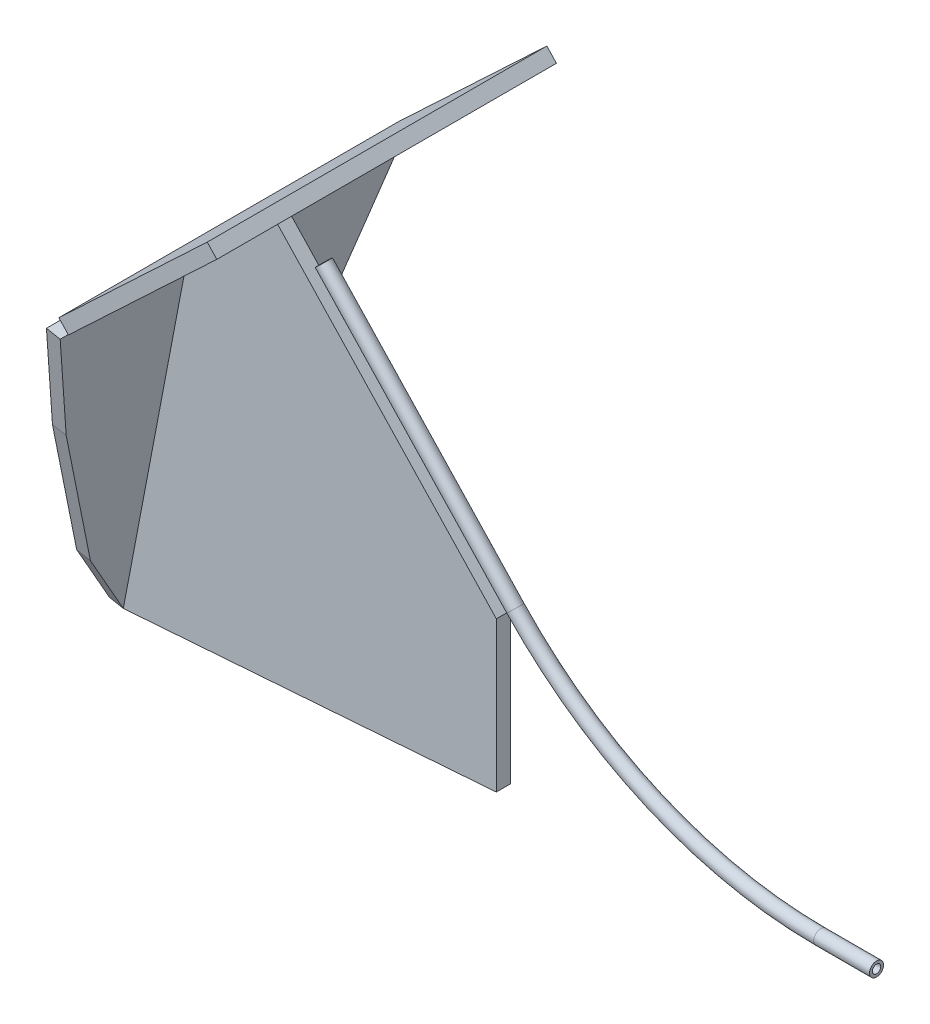
ISO-10303-21;
HEADER;
FILE_DESCRIPTION(('STEP AP214'),'2;1');
FILE_NAME('part.step','',(''),(''),'','','');
FILE_SCHEMA(('AUTOMOTIVE_DESIGN { 1 0 10303 214 1 1 1 1 }'));
ENDSEC;
DATA;
#1=APPLICATION_CONTEXT('core data for automotive mechanical design processes');
#2=APPLICATION_PROTOCOL_DEFINITION('international standard','automotive_design',2000,#1);
#3=PRODUCT_CONTEXT('',#1,'mechanical');
#4=PRODUCT('Part','Part','',(#3));
#5=PRODUCT_RELATED_PRODUCT_CATEGORY('part','',(#4));
#6=PRODUCT_DEFINITION_FORMATION('','',#4);
#7=PRODUCT_DEFINITION_CONTEXT('part definition',#1,'design');
#8=PRODUCT_DEFINITION('design','',#6,#7);
#9=PRODUCT_DEFINITION_SHAPE('','',#8);
#10=(LENGTH_UNIT() NAMED_UNIT(*) SI_UNIT(.MILLI.,.METRE.));
#11=(NAMED_UNIT(*) PLANE_ANGLE_UNIT() SI_UNIT($,.RADIAN.));
#12=(NAMED_UNIT(*) SI_UNIT($,.STERADIAN.) SOLID_ANGLE_UNIT());
#13=UNCERTAINTY_MEASURE_WITH_UNIT(LENGTH_MEASURE(1.E-05),#10,'distance_accuracy_value','');
#14=(GEOMETRIC_REPRESENTATION_CONTEXT(3) GLOBAL_UNCERTAINTY_ASSIGNED_CONTEXT((#13)) GLOBAL_UNIT_ASSIGNED_CONTEXT((#10,
#11,#12)) REPRESENTATION_CONTEXT('',''));
#15=CARTESIAN_POINT('',(0.,0.,0.));
#16=DIRECTION('',(0.,0.,1.));
#17=DIRECTION('',(1.,0.,0.));
#18=AXIS2_PLACEMENT_3D('',#15,#16,#17);
#19=CARTESIAN_POINT('',(-195.801486956078,133.854835002375,6.35));
#20=DIRECTION('',(0.685427348757883,-0.728141023136823,0.));
#21=DIRECTION('',(0.728141023136823,0.685427348757883,0.));
#22=AXIS2_PLACEMENT_3D('',#19,#20,#21);
#23=PLANE('',#22);
#24=DIRECTION('',(0.,0.,1.));
#25=VECTOR('',#24,1.);
#26=CARTESIAN_POINT('',(-232.967224151147,98.8692870098938,-90.9539252993437));
#27=LINE('',#26,#25);
#28=CARTESIAN_POINT('',(-232.967224151147,98.8692870098938,0.));
#29=VERTEX_POINT('',#28);
#30=CARTESIAN_POINT('',(-232.967224151147,98.8692870098938,6.35));
#31=VERTEX_POINT('',#30);
#32=EDGE_CURVE('E233',#29,#31,#27,.T.);
#33=ORIENTED_EDGE('',*,*,#32,.F.);
#34=DIRECTION('',(-0.728141023136823,-0.685427348757883,0.));
#35=VECTOR('',#34,1.);
#36=CARTESIAN_POINT('',(-195.801486956078,133.854835002375,0.));
#37=LINE('',#36,#35);
#38=CARTESIAN_POINT('',(-236.721174295515,95.3355483341922,0.));
#39=VERTEX_POINT('',#38);
#40=EDGE_CURVE('E131',#29,#39,#37,.T.);
#41=ORIENTED_EDGE('',*,*,#40,.T.);
#42=DIRECTION('',(0.,0.,-1.));
#43=VECTOR('',#42,1.);
#44=CARTESIAN_POINT('',(-236.721174295515,95.3355483341922,6.35));
#45=LINE('',#44,#43);
#46=CARTESIAN_POINT('',(-236.721174295515,95.3355483341922,6.35));
#47=VERTEX_POINT('',#46);
#48=EDGE_CURVE('E12',#47,#39,#45,.T.);
#49=ORIENTED_EDGE('',*,*,#48,.F.);
#50=DIRECTION('',(-0.728141023136823,-0.685427348757883,0.));
#51=VECTOR('',#50,1.);
#52=CARTESIAN_POINT('',(-195.801486956078,133.854835002375,6.35));
#53=LINE('',#52,#51);
#54=EDGE_CURVE('E61',#31,#47,#53,.T.);
#55=ORIENTED_EDGE('',*,*,#54,.F.);
#56=EDGE_LOOP('',(#33,#41,#49,#55));
#57=FACE_BOUND('',#56,.T.);
#58=ADVANCED_FACE('F47',(#57),#23,.F.);
#59=CARTESIAN_POINT('',(-95.5521655266669,-40.7968419471678,6.35));
#60=DIRECTION('',(-0.0735843814622596,0.997288994627343,0.));
#61=DIRECTION('',(-0.997288994627343,-0.0735843814622596,0.));
#62=AXIS2_PLACEMENT_3D('',#59,#60,#61);
#63=PLANE('',#62);
#64=DIRECTION('',(0.997288994627343,0.0735843814622596,0.));
#65=VECTOR('',#64,1.);
#66=CARTESIAN_POINT('',(-95.5521655266669,-40.7968419471678,0.));
#67=LINE('',#66,#65);
#68=CARTESIAN_POINT('',(-265.05056523705,-53.3031816026977,0.));
#69=VERTEX_POINT('',#68);
#70=CARTESIAN_POINT('',(-95.5521655266669,-40.7968419471678,0.));
#71=VERTEX_POINT('',#70);
#72=EDGE_CURVE('E116',#69,#71,#67,.T.);
#73=ORIENTED_EDGE('',*,*,#72,.T.);
#74=DIRECTION('',(0.,0.,-1.));
#75=VECTOR('',#74,1.);
#76=CARTESIAN_POINT('',(-95.5521655266669,-40.7968419471678,6.35));
#77=LINE('',#76,#75);
#78=CARTESIAN_POINT('',(-95.5521655266669,-40.7968419471678,6.35));
#79=VERTEX_POINT('',#78);
#80=EDGE_CURVE('E113',#79,#71,#77,.T.);
#81=ORIENTED_EDGE('',*,*,#80,.F.);
#82=DIRECTION('',(0.997288994627343,0.0735843814622596,0.));
#83=VECTOR('',#82,1.);
#84=CARTESIAN_POINT('',(-95.5521655266669,-40.7968419471678,6.35));
#85=LINE('',#84,#83);
#86=CARTESIAN_POINT('',(-265.05056523705,-53.3031816026976,6.35));
#87=VERTEX_POINT('',#86);
#88=EDGE_CURVE('E100',#87,#79,#85,.T.);
#89=ORIENTED_EDGE('',*,*,#88,.F.);
#90=DIRECTION('',(0.,0.,-1.));
#91=VECTOR('',#90,1.);
#92=CARTESIAN_POINT('',(-265.05056523705,-53.3031816026976,6.35));
#93=LINE('',#92,#91);
#94=EDGE_CURVE('E54',#87,#69,#93,.T.);
#95=ORIENTED_EDGE('',*,*,#94,.T.);
#96=EDGE_LOOP('',(#73,#81,#89,#95));
#97=FACE_BOUND('',#96,.T.);
#98=ADVANCED_FACE('F114',(#97),#63,.F.);
#99=CARTESIAN_POINT('',(-95.5521655266669,27.3582914858883,6.35));
#100=DIRECTION('',(-1.,0.,0.));
#101=DIRECTION('',(0.,0.,1.));
#102=AXIS2_PLACEMENT_3D('',#99,#100,#101);
#103=PLANE('',#102);
#104=DIRECTION('',(0.,1.,0.));
#105=VECTOR('',#104,1.);
#106=CARTESIAN_POINT('',(-95.5521655266669,27.3582914858883,0.));
#107=LINE('',#106,#105);
#108=CARTESIAN_POINT('',(-95.5521655266669,27.3582914858883,0.));
#109=VERTEX_POINT('',#108);
#110=EDGE_CURVE('E135',#71,#109,#107,.T.);
#111=ORIENTED_EDGE('',*,*,#110,.T.);
#112=DIRECTION('',(0.,0.,-1.));
#113=VECTOR('',#112,1.);
#114=CARTESIAN_POINT('',(-95.5521655266669,27.3582914858883,6.35));
#115=LINE('',#114,#113);
#116=CARTESIAN_POINT('',(-95.5521655266669,27.3582914858883,6.35));
#117=VERTEX_POINT('',#116);
#118=EDGE_CURVE('E119',#117,#109,#115,.T.);
#119=ORIENTED_EDGE('',*,*,#118,.F.);
#120=DIRECTION('',(0.,1.,0.));
#121=VECTOR('',#120,1.);
#122=CARTESIAN_POINT('',(-95.5521655266669,27.3582914858883,6.35));
#123=LINE('',#122,#121);
#124=EDGE_CURVE('E104',#79,#117,#123,.T.);
#125=ORIENTED_EDGE('',*,*,#124,.F.);
#126=ORIENTED_EDGE('',*,*,#80,.T.);
#127=EDGE_LOOP('',(#111,#119,#125,#126));
#128=FACE_BOUND('',#127,.T.);
#129=ADVANCED_FACE('F121',(#128),#103,.F.);
#130=CARTESIAN_POINT('',(-195.801486956078,133.854835002375,6.35));
#131=DIRECTION('',(-0.728141023136823,-0.685427348757882,0.));
#132=DIRECTION('',(0.685427348757882,-0.728141023136823,0.));
#133=AXIS2_PLACEMENT_3D('',#130,#131,#132);
#134=PLANE('',#133);
#135=DIRECTION('',(-0.685427348757882,0.728141023136823,0.));
#136=VECTOR('',#135,1.);
#137=CARTESIAN_POINT('',(-195.801486956078,133.854835002375,0.));
#138=LINE('',#137,#136);
#139=CARTESIAN_POINT('',(-195.801486956078,133.854835002375,0.));
#140=VERTEX_POINT('',#139);
#141=EDGE_CURVE('E90',#109,#140,#138,.T.);
#142=ORIENTED_EDGE('',*,*,#141,.T.);
#143=DIRECTION('',(0.,0.,-1.));
#144=VECTOR('',#143,1.);
#145=CARTESIAN_POINT('',(-195.801486956078,133.854835002375,6.35));
#146=LINE('',#145,#144);
#147=CARTESIAN_POINT('',(-195.801486956078,133.854835002375,6.35));
#148=VERTEX_POINT('',#147);
#149=EDGE_CURVE('E123',#148,#140,#146,.T.);
#150=ORIENTED_EDGE('',*,*,#149,.F.);
#151=DIRECTION('',(-0.685427348757882,0.728141023136823,0.));
#152=VECTOR('',#151,1.);
#153=CARTESIAN_POINT('',(-195.801486956078,133.854835002375,6.35));
#154=LINE('',#153,#152);
#155=EDGE_CURVE('E69',#117,#148,#154,.T.);
#156=ORIENTED_EDGE('',*,*,#155,.F.);
#157=ORIENTED_EDGE('',*,*,#118,.T.);
#158=EDGE_LOOP('',(#142,#150,#156,#157));
#159=FACE_BOUND('',#158,.T.);
#160=ADVANCED_FACE('F369',(#159),#134,.F.);
#161=CARTESIAN_POINT('',(0.,0.,6.35));
#162=DIRECTION('',(0.,0.,1.));
#163=DIRECTION('',(1.,0.,0.));
#164=AXIS2_PLACEMENT_3D('',#161,#162,#163);
#165=PLANE('',#164);
#166=EDGE_CURVE('E217',#148,#31,#53,.T.);
#167=ORIENTED_EDGE('',*,*,#166,.T.);
#168=ORIENTED_EDGE('',*,*,#54,.T.);
#169=DIRECTION('',(-0.187222128685202,-0.982317603695761,0.));
#170=VECTOR('',#169,1.);
#171=CARTESIAN_POINT('',(-236.721174295515,95.3355483341922,6.35));
#172=LINE('',#171,#170);
#173=EDGE_CURVE('E107',#47,#87,#172,.T.);
#174=ORIENTED_EDGE('',*,*,#173,.T.);
#175=ORIENTED_EDGE('',*,*,#88,.T.);
#176=ORIENTED_EDGE('',*,*,#124,.T.);
#177=ORIENTED_EDGE('',*,*,#155,.T.);
#178=EDGE_LOOP('',(#167,#168,#174,#175,#176,#177));
#179=FACE_BOUND('',#178,.T.);
#180=ADVANCED_FACE('F102',(#179),#165,.T.);
#181=CARTESIAN_POINT('',(0.,0.,0.));
#182=DIRECTION('',(0.,0.,1.));
#183=DIRECTION('',(1.,0.,0.));
#184=AXIS2_PLACEMENT_3D('',#181,#182,#183);
#185=PLANE('',#184);
#186=EDGE_CURVE('E127',#140,#29,#37,.T.);
#187=ORIENTED_EDGE('',*,*,#186,.F.);
#188=ORIENTED_EDGE('',*,*,#141,.F.);
#189=ORIENTED_EDGE('',*,*,#110,.F.);
#190=ORIENTED_EDGE('',*,*,#72,.F.);
#191=DIRECTION('',(-0.187222128685202,-0.982317603695761,0.));
#192=VECTOR('',#191,1.);
#193=CARTESIAN_POINT('',(-236.721174295515,95.3355483341922,0.));
#194=LINE('',#193,#192);
#195=EDGE_CURVE('E130',#39,#69,#194,.T.);
#196=ORIENTED_EDGE('',*,*,#195,.F.);
#197=ORIENTED_EDGE('',*,*,#40,.F.);
#198=EDGE_LOOP('',(#187,#188,#189,#190,#196,#197));
#199=FACE_BOUND('',#198,.T.);
#200=ADVANCED_FACE('F374',(#199),#185,.F.);
#201=CARTESIAN_POINT('',(-245.956906538288,46.8774818181795,1.4358910261368E-13));
#202=DIRECTION('',(-0.982317603695761,0.187222128685202,0.));
#203=DIRECTION('',(-0.187222128685202,-0.982317603695761,0.));
#204=AXIS2_PLACEMENT_3D('',#201,#202,#203);
#205=PLANE('',#204);
#206=DIRECTION('',(0.,0.,-1.));
#207=VECTOR('',#206,1.);
#208=CARTESIAN_POINT('',(-236.721174295515,95.3355483341922,63.3787371386979));
#209=LINE('',#208,#207);
#210=CARTESIAN_POINT('',(-236.721174295515,95.3355483341922,-91.382911391392));
#211=VERTEX_POINT('',#210);
#212=EDGE_CURVE('E156',#39,#211,#209,.T.);
#213=ORIENTED_EDGE('',*,*,#212,.F.);
#214=ORIENTED_EDGE('',*,*,#195,.T.);
#215=DIRECTION('',(0.,0.,1.));
#216=VECTOR('',#215,1.);
#217=CARTESIAN_POINT('',(-265.05056523705,-53.3031816026977,-8.37775683915182));
#218=LINE('',#217,#216);
#219=CARTESIAN_POINT('',(-265.05056523705,-53.3031816026977,-8.37775683915182));
#220=VERTEX_POINT('',#219);
#221=EDGE_CURVE('E152',#220,#69,#218,.T.);
#222=ORIENTED_EDGE('',*,*,#221,.F.);
#223=DIRECTION('',(-0.119735136367664,-0.628226658145915,0.768761837706473));
#224=VECTOR('',#223,1.);
#225=CARTESIAN_POINT('',(-259.752568537738,-25.5056372707081,-42.3936506050353));
#226=LINE('',#225,#224);
#227=CARTESIAN_POINT('',(-259.752568537738,-25.5056372707081,-42.3936506050353));
#228=VERTEX_POINT('',#227);
#229=EDGE_CURVE('E165',#228,#220,#226,.T.);
#230=ORIENTED_EDGE('',*,*,#229,.F.);
#231=DIRECTION('',(-0.171894702021472,-0.901897617357216,0.396273768021965));
#232=VECTOR('',#231,1.);
#233=CARTESIAN_POINT('',(-248.676200610661,32.6098818518906,-67.9283180662349));
#234=LINE('',#233,#232);
#235=CARTESIAN_POINT('',(-248.676200610661,32.6098818518906,-67.9283180662349));
#236=VERTEX_POINT('',#235);
#237=EDGE_CURVE('E188',#236,#228,#234,.T.);
#238=ORIENTED_EDGE('',*,*,#237,.F.);
#239=DIRECTION('',(-0.175674118334708,-0.921727469748372,0.345770264277579));
#240=VECTOR('',#239,1.);
#241=CARTESIAN_POINT('',(-242.271919160637,66.2118841983054,-80.5335333960411));
#242=LINE('',#241,#240);
#243=CARTESIAN_POINT('',(-242.271919160637,66.2118841983054,-80.5335333960411));
#244=VERTEX_POINT('',#243);
#245=EDGE_CURVE('E185',#244,#236,#242,.T.);
#246=ORIENTED_EDGE('',*,*,#245,.F.);
#247=DIRECTION('',(-0.17581963915527,-0.92249098880858,0.343653648393668));
#248=VECTOR('',#247,1.);
#249=CARTESIAN_POINT('',(-236.721174295515,95.3355483341922,-91.382911391392));
#250=LINE('',#249,#248);
#251=EDGE_CURVE('E182',#211,#244,#250,.T.);
#252=ORIENTED_EDGE('',*,*,#251,.F.);
#253=EDGE_LOOP('',(#213,#214,#222,#230,#238,#246,#252));
#254=FACE_BOUND('',#253,.T.);
#255=ADVANCED_FACE('F149',(#254),#205,.F.);
#256=CARTESIAN_POINT('',(-265.990285321206,-24.3167767535571,-42.3936506050353));
#257=DIRECTION('',(0.143929227707353,0.755168286228572,0.639535172516858));
#258=DIRECTION('',(0.,-0.646264084724581,0.763113839997087));
#259=AXIS2_PLACEMENT_3D('',#256,#257,#258);
#260=PLANE('',#259);
#261=ORIENTED_EDGE('',*,*,#229,.T.);
#262=DIRECTION('',(0.982317603695761,-0.187222128685202,0.));
#263=VECTOR('',#262,1.);
#264=CARTESIAN_POINT('',(-271.288282020518,-52.1143210855466,-8.37775683915182));
#265=LINE('',#264,#263);
#266=CARTESIAN_POINT('',(-271.288282020518,-52.1143210855466,-8.37775683915182));
#267=VERTEX_POINT('',#266);
#268=EDGE_CURVE('E162',#267,#220,#265,.T.);
#269=ORIENTED_EDGE('',*,*,#268,.F.);
#270=DIRECTION('',(-0.119735136367664,-0.628226658145915,0.768761837706473));
#271=VECTOR('',#270,1.);
#272=CARTESIAN_POINT('',(-265.990285321206,-24.3167767535571,-42.3936506050353));
#273=LINE('',#272,#271);
#274=CARTESIAN_POINT('',(-265.990285321206,-24.3167767535571,-42.3936506050353));
#275=VERTEX_POINT('',#274);
#276=EDGE_CURVE('E191',#275,#267,#273,.T.);
#277=ORIENTED_EDGE('',*,*,#276,.F.);
#278=DIRECTION('',(0.982317603695761,-0.187222128685202,0.));
#279=VECTOR('',#278,1.);
#280=CARTESIAN_POINT('',(-265.990285321206,-24.3167767535571,-42.3936506050353));
#281=LINE('',#280,#279);
#282=EDGE_CURVE('E192',#275,#228,#281,.T.);
#283=ORIENTED_EDGE('',*,*,#282,.T.);
#284=EDGE_LOOP('',(#261,#269,#277,#283));
#285=FACE_BOUND('',#284,.T.);
#286=ADVANCED_FACE('F295',(#285),#260,.F.);
#287=CARTESIAN_POINT('',(-271.288282020518,-52.1143210855466,-8.37775683915182));
#288=DIRECTION('',(0.187222128685202,0.982317603695761,0.));
#289=DIRECTION('',(-0.982317603695761,0.187222128685202,0.));
#290=AXIS2_PLACEMENT_3D('',#287,#288,#289);
#291=PLANE('',#290);
#292=ORIENTED_EDGE('',*,*,#221,.T.);
#293=ORIENTED_EDGE('',*,*,#94,.F.);
#294=DIRECTION('',(0.982317603695761,-0.187222128685202,0.));
#295=VECTOR('',#294,1.);
#296=CARTESIAN_POINT('',(-271.288282020518,-52.1143210855466,6.35));
#297=LINE('',#296,#295);
#298=CARTESIAN_POINT('',(-271.288282020518,-52.1143210855466,6.35));
#299=VERTEX_POINT('',#298);
#300=EDGE_CURVE('E214',#299,#87,#297,.T.);
#301=ORIENTED_EDGE('',*,*,#300,.F.);
#302=DIRECTION('',(0.,0.,1.));
#303=VECTOR('',#302,1.);
#304=CARTESIAN_POINT('',(-271.288282020518,-52.1143210855466,-8.37775683915182));
#305=LINE('',#304,#303);
#306=EDGE_CURVE('E259',#267,#299,#305,.T.);
#307=ORIENTED_EDGE('',*,*,#306,.F.);
#308=ORIENTED_EDGE('',*,*,#268,.T.);
#309=EDGE_LOOP('',(#292,#293,#301,#307,#308));
#310=FACE_BOUND('',#309,.T.);
#311=ADVANCED_FACE('F159',(#310),#291,.F.);
#312=CARTESIAN_POINT('',(-271.288282020518,-52.1143210855466,6.35));
#313=DIRECTION('',(0.100832064760659,0.529045967626665,-0.842581306969285));
#314=DIRECTION('',(0.,0.846897554231977,0.531756083778922));
#315=AXIS2_PLACEMENT_3D('',#312,#313,#314);
#316=PLANE('',#315);
#317=DIRECTION('',(0.15774986588115,0.82768245038091,0.538569160968145));
#318=VECTOR('',#317,1.);
#319=CARTESIAN_POINT('',(-265.05056523705,-53.3031816026977,6.35));
#320=LINE('',#319,#318);
#321=CARTESIAN_POINT('',(-258.852842799703,-20.7849536785671,27.5094612416997));
#322=VERTEX_POINT('',#321);
#323=EDGE_CURVE('E164',#87,#322,#320,.T.);
#324=ORIENTED_EDGE('',*,*,#323,.T.);
#325=DIRECTION('',(0.982317603695761,-0.187222128685202,0.));
#326=VECTOR('',#325,1.);
#327=CARTESIAN_POINT('',(-265.090559583171,-19.5960931614161,27.5094612416997));
#328=LINE('',#327,#326);
#329=CARTESIAN_POINT('',(-265.090559583171,-19.5960931614161,27.5094612416997));
#330=VERTEX_POINT('',#329);
#331=EDGE_CURVE('E211',#330,#322,#328,.T.);
#332=ORIENTED_EDGE('',*,*,#331,.F.);
#333=DIRECTION('',(0.15774986588115,0.82768245038091,0.538569160968145));
#334=VECTOR('',#333,1.);
#335=CARTESIAN_POINT('',(-271.288282020518,-52.1143210855466,6.35));
#336=LINE('',#335,#334);
#337=EDGE_CURVE('E262',#299,#330,#336,.T.);
#338=ORIENTED_EDGE('',*,*,#337,.F.);
#339=ORIENTED_EDGE('',*,*,#300,.T.);
#340=EDGE_LOOP('',(#324,#332,#338,#339));
#341=FACE_BOUND('',#340,.T.);
#342=ADVANCED_FACE('F344',(#341),#316,.F.);
#343=CARTESIAN_POINT('',(-265.090559583171,-19.5960931614161,27.5094612416997));
#344=DIRECTION('',(0.0613824363231179,0.322061543586641,-0.944726711093546));
#345=DIRECTION('',(0.,0.946511528610491,0.322669995827673));
#346=AXIS2_PLACEMENT_3D('',#343,#344,#345);
#347=PLANE('',#346);
#348=DIRECTION('',(0.176873745876703,0.92802167898879,0.327858874130885));
#349=VECTOR('',#348,1.);
#350=CARTESIAN_POINT('',(-258.852842799703,-20.7849536785671,27.5094612416997));
#351=LINE('',#350,#349);
#352=CARTESIAN_POINT('',(-245.956906538288,46.8774818181793,51.4137841957596));
#353=VERTEX_POINT('',#352);
#354=EDGE_CURVE('E168',#322,#353,#351,.T.);
#355=ORIENTED_EDGE('',*,*,#354,.T.);
#356=DIRECTION('',(0.982317603695761,-0.187222128685202,0.));
#357=VECTOR('',#356,1.);
#358=CARTESIAN_POINT('',(-252.194623321756,48.0663423353304,51.4137841957596));
#359=LINE('',#358,#357);
#360=CARTESIAN_POINT('',(-252.194623321756,48.0663423353304,51.4137841957596));
#361=VERTEX_POINT('',#360);
#362=EDGE_CURVE('E208',#361,#353,#359,.T.);
#363=ORIENTED_EDGE('',*,*,#362,.F.);
#364=DIRECTION('',(0.176873745876703,0.92802167898879,0.327858874130885));
#365=VECTOR('',#364,1.);
#366=CARTESIAN_POINT('',(-265.090559583171,-19.5960931614161,27.5094612416997));
#367=LINE('',#366,#365);
#368=EDGE_CURVE('E265',#330,#361,#367,.T.);
#369=ORIENTED_EDGE('',*,*,#368,.F.);
#370=ORIENTED_EDGE('',*,*,#331,.T.);
#371=EDGE_LOOP('',(#355,#363,#369,#370));
#372=FACE_BOUND('',#371,.T.);
#373=ADVANCED_FACE('F348',(#372),#347,.F.);
#374=CARTESIAN_POINT('',(-252.194623321756,48.0663423353304,51.4137841957596));
#375=DIRECTION('',(0.044130723100144,0.231545204990082,-0.971822667632711));
#376=DIRECTION('',(0.,0.972770374508012,0.231771004397753));
#377=AXIS2_PLACEMENT_3D('',#374,#375,#376);
#378=PLANE('',#377);
#379=DIRECTION('',(0.181946708538727,0.954638514086187,0.235713178832328));
#380=VECTOR('',#379,1.);
#381=CARTESIAN_POINT('',(-245.956906538288,46.8774818181793,51.4137841957596));
#382=LINE('',#381,#380);
#383=CARTESIAN_POINT('',(-236.721174295515,95.3355483341922,63.3787371386979));
#384=VERTEX_POINT('',#383);
#385=EDGE_CURVE('E176',#353,#384,#382,.T.);
#386=ORIENTED_EDGE('',*,*,#385,.T.);
#387=DIRECTION('',(0.982317603695761,-0.187222128685202,0.));
#388=VECTOR('',#387,1.);
#389=CARTESIAN_POINT('',(-242.958891078983,96.5244088513432,63.3787371386979));
#390=LINE('',#389,#388);
#391=CARTESIAN_POINT('',(-242.958891078983,96.5244088513432,63.3787371386979));
#392=VERTEX_POINT('',#391);
#393=EDGE_CURVE('E205',#392,#384,#390,.T.);
#394=ORIENTED_EDGE('',*,*,#393,.F.);
#395=DIRECTION('',(0.181946708538727,0.954638514086187,0.235713178832328));
#396=VECTOR('',#395,1.);
#397=CARTESIAN_POINT('',(-252.194623321756,48.0663423353304,51.4137841957596));
#398=LINE('',#397,#396);
#399=EDGE_CURVE('E268',#361,#392,#398,.T.);
#400=ORIENTED_EDGE('',*,*,#399,.F.);
#401=ORIENTED_EDGE('',*,*,#362,.T.);
#402=EDGE_LOOP('',(#386,#394,#400,#401));
#403=FACE_BOUND('',#402,.T.);
#404=ADVANCED_FACE('F353',(#403),#378,.F.);
#405=CARTESIAN_POINT('',(-242.958891078983,96.5244088513432,63.3787371386979));
#406=DIRECTION('',(-0.187222128685202,-0.982317603695761,0.));
#407=DIRECTION('',(0.982317603695761,-0.187222128685202,0.));
#408=AXIS2_PLACEMENT_3D('',#405,#406,#407);
#409=PLANE('',#408);
#410=EDGE_CURVE('E179',#384,#47,#209,.T.);
#411=ORIENTED_EDGE('',*,*,#410,.T.);
#412=ORIENTED_EDGE('',*,*,#48,.T.);
#413=ORIENTED_EDGE('',*,*,#212,.T.);
#414=DIRECTION('',(0.982317603695761,-0.187222128685202,0.));
#415=VECTOR('',#414,1.);
#416=CARTESIAN_POINT('',(-242.958891078983,96.5244088513432,-91.382911391392));
#417=LINE('',#416,#415);
#418=CARTESIAN_POINT('',(-242.958891078983,96.5244088513432,-91.382911391392));
#419=VERTEX_POINT('',#418);
#420=EDGE_CURVE('E202',#419,#211,#417,.T.);
#421=ORIENTED_EDGE('',*,*,#420,.F.);
#422=DIRECTION('',(0.,0.,-1.));
#423=VECTOR('',#422,1.);
#424=CARTESIAN_POINT('',(-242.958891078983,96.5244088513432,63.3787371386979));
#425=LINE('',#424,#423);
#426=EDGE_CURVE('E271',#392,#419,#425,.T.);
#427=ORIENTED_EDGE('',*,*,#426,.F.);
#428=ORIENTED_EDGE('',*,*,#393,.T.);
#429=EDGE_LOOP('',(#411,#412,#413,#421,#427,#428));
#430=FACE_BOUND('',#429,.T.);
#431=ADVANCED_FACE('F335',(#430),#409,.F.);
#432=CARTESIAN_POINT('',(-242.958891078983,96.5244088513432,-91.382911391392));
#433=DIRECTION('',(0.0643395675826984,0.337577028391374,0.939096464664691));
#434=DIRECTION('',(0.,-0.941046252686102,0.338277918737603));
#435=AXIS2_PLACEMENT_3D('',#432,#433,#434);
#436=PLANE('',#435);
#437=ORIENTED_EDGE('',*,*,#251,.T.);
#438=DIRECTION('',(0.982317603695761,-0.187222128685202,0.));
#439=VECTOR('',#438,1.);
#440=CARTESIAN_POINT('',(-248.509635944105,67.4007447154564,-80.5335333960411));
#441=LINE('',#440,#439);
#442=CARTESIAN_POINT('',(-248.509635944105,67.4007447154564,-80.5335333960411));
#443=VERTEX_POINT('',#442);
#444=EDGE_CURVE('E199',#443,#244,#441,.T.);
#445=ORIENTED_EDGE('',*,*,#444,.F.);
#446=DIRECTION('',(-0.17581963915527,-0.92249098880858,0.343653648393668));
#447=VECTOR('',#446,1.);
#448=CARTESIAN_POINT('',(-242.958891078983,96.5244088513432,-91.382911391392));
#449=LINE('',#448,#447);
#450=EDGE_CURVE('E274',#419,#443,#449,.T.);
#451=ORIENTED_EDGE('',*,*,#450,.F.);
#452=ORIENTED_EDGE('',*,*,#420,.T.);
#453=EDGE_LOOP('',(#437,#445,#451,#452));
#454=FACE_BOUND('',#453,.T.);
#455=ADVANCED_FACE('F330',(#454),#436,.F.);
#456=CARTESIAN_POINT('',(-248.509635944105,67.4007447154564,-80.5335333960411));
#457=DIRECTION('',(0.064735844914093,0.339656217434401,0.938319201733298));
#458=DIRECTION('',(0.,-0.940291524039199,0.340370165878328));
#459=AXIS2_PLACEMENT_3D('',#456,#457,#458);
#460=PLANE('',#459);
#461=ORIENTED_EDGE('',*,*,#245,.T.);
#462=DIRECTION('',(0.982317603695761,-0.187222128685202,0.));
#463=VECTOR('',#462,1.);
#464=CARTESIAN_POINT('',(-254.913917394129,33.7987423690417,-67.9283180662349));
#465=LINE('',#464,#463);
#466=CARTESIAN_POINT('',(-254.913917394129,33.7987423690417,-67.9283180662349));
#467=VERTEX_POINT('',#466);
#468=EDGE_CURVE('E195',#467,#236,#465,.T.);
#469=ORIENTED_EDGE('',*,*,#468,.F.);
#470=DIRECTION('',(-0.175674118334708,-0.921727469748372,0.345770264277579));
#471=VECTOR('',#470,1.);
#472=CARTESIAN_POINT('',(-248.509635944105,67.4007447154564,-80.5335333960411));
#473=LINE('',#472,#471);
#474=EDGE_CURVE('E277',#443,#467,#473,.T.);
#475=ORIENTED_EDGE('',*,*,#474,.F.);
#476=ORIENTED_EDGE('',*,*,#444,.T.);
#477=EDGE_LOOP('',(#461,#469,#475,#476));
#478=FACE_BOUND('',#477,.T.);
#479=ADVANCED_FACE('F327',(#478),#460,.F.);
#480=CARTESIAN_POINT('',(-254.913917394129,33.7987423690417,-67.9283180662349));
#481=DIRECTION('',(0.074191218391178,0.389266698210826,0.918132398283425));
#482=DIRECTION('',(0.,-0.920669732872911,0.39034246882926));
#483=AXIS2_PLACEMENT_3D('',#480,#481,#482);
#484=PLANE('',#483);
#485=ORIENTED_EDGE('',*,*,#237,.T.);
#486=ORIENTED_EDGE('',*,*,#282,.F.);
#487=DIRECTION('',(-0.171894702021472,-0.901897617357216,0.396273768021965));
#488=VECTOR('',#487,1.);
#489=CARTESIAN_POINT('',(-254.913917394129,33.7987423690417,-67.9283180662349));
#490=LINE('',#489,#488);
#491=EDGE_CURVE('E196',#467,#275,#490,.T.);
#492=ORIENTED_EDGE('',*,*,#491,.F.);
#493=ORIENTED_EDGE('',*,*,#468,.T.);
#494=EDGE_LOOP('',(#485,#486,#492,#493));
#495=FACE_BOUND('',#494,.T.);
#496=ADVANCED_FACE('F291',(#495),#484,.F.);
#497=CARTESIAN_POINT('',(-252.194623321756,48.0663423353305,1.4358910261368E-13));
#498=DIRECTION('',(-0.982317603695761,0.187222128685202,0.));
#499=DIRECTION('',(-0.187222128685202,-0.982317603695761,0.));
#500=AXIS2_PLACEMENT_3D('',#497,#498,#499);
#501=PLANE('',#500);
#502=ORIENTED_EDGE('',*,*,#276,.T.);
#503=ORIENTED_EDGE('',*,*,#306,.T.);
#504=ORIENTED_EDGE('',*,*,#337,.T.);
#505=ORIENTED_EDGE('',*,*,#368,.T.);
#506=ORIENTED_EDGE('',*,*,#399,.T.);
#507=ORIENTED_EDGE('',*,*,#426,.T.);
#508=ORIENTED_EDGE('',*,*,#450,.T.);
#509=ORIENTED_EDGE('',*,*,#474,.T.);
#510=ORIENTED_EDGE('',*,*,#491,.T.);
#511=EDGE_LOOP('',(#502,#503,#504,#505,#506,#507,#508,#509,#510));
#512=FACE_BOUND('',#511,.T.);
#513=ADVANCED_FACE('F283',(#512),#501,.T.);
#514=ORIENTED_EDGE('',*,*,#173,.F.);
#515=ORIENTED_EDGE('',*,*,#410,.F.);
#516=ORIENTED_EDGE('',*,*,#385,.F.);
#517=ORIENTED_EDGE('',*,*,#354,.F.);
#518=ORIENTED_EDGE('',*,*,#323,.F.);
#519=EDGE_LOOP('',(#514,#515,#516,#517,#518));
#520=FACE_BOUND('',#519,.T.);
#521=ADVANCED_FACE('F339',(#520),#205,.F.);
#522=CARTESIAN_POINT('',(-169.894141042964,166.963261332654,63.3787371386979));
#523=DIRECTION('',(-0.728141023136823,-0.685427348757883,0.));
#524=DIRECTION('',(0.685427348757883,-0.728141023136823,0.));
#525=AXIS2_PLACEMENT_3D('',#522,#523,#524);
#526=PLANE('',#525);
#527=DIRECTION('',(0.,0.,-1.));
#528=VECTOR('',#527,1.);
#529=CARTESIAN_POINT('',(-165.541677378352,162.339565835735,63.3787371386979));
#530=LINE('',#529,#528);
#531=CARTESIAN_POINT('',(-165.541677378352,162.339565835735,63.3787371386979));
#532=VERTEX_POINT('',#531);
#533=CARTESIAN_POINT('',(-165.541677378352,162.339565835735,-90.9539252993437));
#534=VERTEX_POINT('',#533);
#535=EDGE_CURVE('E546',#532,#534,#530,.T.);
#536=ORIENTED_EDGE('',*,*,#535,.T.);
#537=DIRECTION('',(0.685427348757883,-0.728141023136823,0.));
#538=VECTOR('',#537,1.);
#539=CARTESIAN_POINT('',(-169.894141042964,166.963261332654,-90.9539252993437));
#540=LINE('',#539,#538);
#541=CARTESIAN_POINT('',(-169.894141042964,166.963261332654,-90.9539252993437));
#542=VERTEX_POINT('',#541);
#543=EDGE_CURVE('E170',#542,#534,#540,.T.);
#544=ORIENTED_EDGE('',*,*,#543,.F.);
#545=DIRECTION('',(0.,0.,-1.));
#546=VECTOR('',#545,1.);
#547=CARTESIAN_POINT('',(-169.894141042964,166.963261332654,63.3787371386979));
#548=LINE('',#547,#546);
#549=CARTESIAN_POINT('',(-169.894141042964,166.963261332654,63.3787371386979));
#550=VERTEX_POINT('',#549);
#551=EDGE_CURVE('E246',#550,#542,#548,.T.);
#552=ORIENTED_EDGE('',*,*,#551,.F.);
#553=DIRECTION('',(0.685427348757883,-0.728141023136823,0.));
#554=VECTOR('',#553,1.);
#555=CARTESIAN_POINT('',(-169.894141042964,166.963261332654,63.3787371386979));
#556=LINE('',#555,#554);
#557=EDGE_CURVE('E247',#550,#532,#556,.T.);
#558=ORIENTED_EDGE('',*,*,#557,.T.);
#559=EDGE_LOOP('',(#536,#544,#552,#558));
#560=FACE_BOUND('',#559,.T.);
#561=ADVANCED_FACE('F442',(#560),#526,.F.);
#562=CARTESIAN_POINT('',(-169.894141042964,166.963261332654,-90.9539252993437));
#563=DIRECTION('',(0.,0.,1.));
#564=DIRECTION('',(1.,0.,0.));
#565=AXIS2_PLACEMENT_3D('',#562,#563,#564);
#566=PLANE('',#565);
#567=DIRECTION('',(-0.728141023136823,-0.685427348757882,0.));
#568=VECTOR('',#567,1.);
#569=CARTESIAN_POINT('',(-165.541677378352,162.339565835735,-90.9539252993437));
#570=LINE('',#569,#568);
#571=CARTESIAN_POINT('',(-232.967224151147,98.8692870098938,-90.9539252993437));
#572=VERTEX_POINT('',#571);
#573=EDGE_CURVE('E234',#534,#572,#570,.T.);
#574=ORIENTED_EDGE('',*,*,#573,.T.);
#575=DIRECTION('',(0.685427348757883,-0.728141023136823,0.));
#576=VECTOR('',#575,1.);
#577=CARTESIAN_POINT('',(-237.319687815759,103.492982506813,-90.9539252993437));
#578=LINE('',#577,#576);
#579=CARTESIAN_POINT('',(-237.319687815759,103.492982506813,-90.9539252993437));
#580=VERTEX_POINT('',#579);
#581=EDGE_CURVE('E253',#580,#572,#578,.T.);
#582=ORIENTED_EDGE('',*,*,#581,.F.);
#583=DIRECTION('',(-0.728141023136823,-0.685427348757882,0.));
#584=VECTOR('',#583,1.);
#585=CARTESIAN_POINT('',(-169.894141042964,166.963261332654,-90.9539252993437));
#586=LINE('',#585,#584);
#587=EDGE_CURVE('E536',#542,#580,#586,.T.);
#588=ORIENTED_EDGE('',*,*,#587,.F.);
#589=ORIENTED_EDGE('',*,*,#543,.T.);
#590=EDGE_LOOP('',(#574,#582,#588,#589));
#591=FACE_BOUND('',#590,.T.);
#592=ADVANCED_FACE('F477',(#591),#566,.F.);
#593=CARTESIAN_POINT('',(-237.319687815759,103.492982506813,-90.9539252993437));
#594=DIRECTION('',(0.728141023136823,0.685427348757883,0.));
#595=DIRECTION('',(-0.685427348757883,0.728141023136823,0.));
#596=AXIS2_PLACEMENT_3D('',#593,#594,#595);
#597=PLANE('',#596);
#598=EDGE_CURVE('E236',#572,#29,#27,.T.);
#599=ORIENTED_EDGE('',*,*,#598,.T.);
#600=ORIENTED_EDGE('',*,*,#32,.T.);
#601=CARTESIAN_POINT('',(-232.967224151147,98.8692870098938,63.3787371386979));
#602=VERTEX_POINT('',#601);
#603=EDGE_CURVE('E223',#31,#602,#27,.T.);
#604=ORIENTED_EDGE('',*,*,#603,.T.);
#605=DIRECTION('',(0.685427348757883,-0.728141023136823,0.));
#606=VECTOR('',#605,1.);
#607=CARTESIAN_POINT('',(-237.319687815759,103.492982506813,63.3787371386979));
#608=LINE('',#607,#606);
#609=CARTESIAN_POINT('',(-237.319687815759,103.492982506813,63.3787371386979));
#610=VERTEX_POINT('',#609);
#611=EDGE_CURVE('E250',#610,#602,#608,.T.);
#612=ORIENTED_EDGE('',*,*,#611,.F.);
#613=DIRECTION('',(0.,0.,1.));
#614=VECTOR('',#613,1.);
#615=CARTESIAN_POINT('',(-237.319687815759,103.492982506813,-90.9539252993437));
#616=LINE('',#615,#614);
#617=EDGE_CURVE('E557',#580,#610,#616,.T.);
#618=ORIENTED_EDGE('',*,*,#617,.F.);
#619=ORIENTED_EDGE('',*,*,#581,.T.);
#620=EDGE_LOOP('',(#599,#600,#604,#612,#618,#619));
#621=FACE_BOUND('',#620,.T.);
#622=ADVANCED_FACE('F238',(#621),#597,.F.);
#623=CARTESIAN_POINT('',(-237.319687815759,103.492982506813,63.3787371386979));
#624=DIRECTION('',(0.,0.,-1.));
#625=DIRECTION('',(-1.,0.,0.));
#626=AXIS2_PLACEMENT_3D('',#623,#624,#625);
#627=PLANE('',#626);
#628=DIRECTION('',(0.728141023136823,0.685427348757883,0.));
#629=VECTOR('',#628,1.);
#630=CARTESIAN_POINT('',(-232.967224151147,98.8692870098938,63.3787371386979));
#631=LINE('',#630,#629);
#632=EDGE_CURVE('E229',#602,#532,#631,.T.);
#633=ORIENTED_EDGE('',*,*,#632,.T.);
#634=ORIENTED_EDGE('',*,*,#557,.F.);
#635=DIRECTION('',(0.728141023136823,0.685427348757883,0.));
#636=VECTOR('',#635,1.);
#637=CARTESIAN_POINT('',(-237.319687815759,103.492982506813,63.3787371386979));
#638=LINE('',#637,#636);
#639=EDGE_CURVE('E251',#610,#550,#638,.T.);
#640=ORIENTED_EDGE('',*,*,#639,.F.);
#641=ORIENTED_EDGE('',*,*,#611,.T.);
#642=EDGE_LOOP('',(#633,#634,#640,#641));
#643=FACE_BOUND('',#642,.T.);
#644=ADVANCED_FACE('F496',(#643),#627,.F.);
#645=CARTESIAN_POINT('',(-163.147398845998,173.314231089718,0.));
#646=DIRECTION('',(-0.685427348757882,0.728141023136823,0.));
#647=DIRECTION('',(-0.728141023136823,-0.685427348757882,0.));
#648=AXIS2_PLACEMENT_3D('',#645,#646,#647);
#649=PLANE('',#648);
#650=ORIENTED_EDGE('',*,*,#551,.T.);
#651=ORIENTED_EDGE('',*,*,#587,.T.);
#652=ORIENTED_EDGE('',*,*,#617,.T.);
#653=ORIENTED_EDGE('',*,*,#639,.T.);
#654=EDGE_LOOP('',(#650,#651,#652,#653));
#655=FACE_BOUND('',#654,.T.);
#656=ADVANCED_FACE('F505',(#655),#649,.T.);
#657=CARTESIAN_POINT('',(-158.794935181385,168.690535592799,0.));
#658=DIRECTION('',(-0.685427348757882,0.728141023136823,0.));
#659=DIRECTION('',(-0.728141023136823,-0.685427348757882,0.));
#660=AXIS2_PLACEMENT_3D('',#657,#658,#659);
#661=PLANE('',#660);
#662=ORIENTED_EDGE('',*,*,#166,.F.);
#663=ORIENTED_EDGE('',*,*,#149,.T.);
#664=ORIENTED_EDGE('',*,*,#186,.T.);
#665=ORIENTED_EDGE('',*,*,#598,.F.);
#666=ORIENTED_EDGE('',*,*,#573,.F.);
#667=ORIENTED_EDGE('',*,*,#535,.F.);
#668=ORIENTED_EDGE('',*,*,#632,.F.);
#669=ORIENTED_EDGE('',*,*,#603,.F.);
#670=EDGE_LOOP('',(#662,#663,#664,#665,#666,#667,#668,#669));
#671=FACE_BOUND('',#670,.T.);
#672=ADVANCED_FACE('F225',(#671),#661,.F.);
#673=CLOSED_SHELL('',(#58,#98,#129,#160,#180,#200,#255,#286,#311,#342,#373,#404,#431,#455,#479,
#496,#513,#521,#561,#592,#622,#644,#656,#672));
#674=MANIFOLD_SOLID_BREP('B2',#673);
#675=CARTESIAN_POINT('',(70.8705471293576,-30.3915667434289,2.12223176285775E-13));
#676=DIRECTION('',(-1.,0.,0.));
#677=DIRECTION('',(0.,-1.,0.));
#678=AXIS2_PLACEMENT_3D('',#675,#676,#677);
#679=CYLINDRICAL_SURFACE('',#678,3.175);
#680=CARTESIAN_POINT('',(45.4705471293576,-30.3915667434289,2.12223176285775E-13));
#681=DIRECTION('',(1.,0.,0.));
#682=DIRECTION('',(0.,0.,-1.));
#683=AXIS2_PLACEMENT_3D('',#680,#681,#682);
#684=CIRCLE('',#683,3.175);
#685=CARTESIAN_POINT('',(45.4705471293576,-33.5665667434289,2.12223176285775E-13));
#686=VERTEX_POINT('',#685);
#687=EDGE_CURVE('E657',#686,#686,#684,.T.);
#688=ORIENTED_EDGE('',*,*,#687,.T.);
#689=EDGE_LOOP('',(#688));
#690=FACE_BOUND('',#689,.T.);
#691=CARTESIAN_POINT('',(70.8705471293576,-30.3915667434289,2.12223176285775E-13));
#692=DIRECTION('',(1.,0.,0.));
#693=DIRECTION('',(0.,0.,-1.));
#694=AXIS2_PLACEMENT_3D('',#691,#692,#693);
#695=CIRCLE('',#694,3.175);
#696=CARTESIAN_POINT('',(70.8705471293576,-30.3915667434289,-3.17499999999979));
#697=VERTEX_POINT('',#696);
#698=EDGE_CURVE('E606',#697,#697,#695,.T.);
#699=ORIENTED_EDGE('',*,*,#698,.F.);
#700=EDGE_LOOP('',(#699));
#701=FACE_BOUND('',#700,.T.);
#702=ADVANCED_FACE('F591',(#690,#701),#679,.T.);
#703=CARTESIAN_POINT('',(45.4705471293576,160.108433256571,2.12223176285775E-13));
#704=DIRECTION('',(0.,0.,-1.));
#705=DIRECTION('',(-1.,0.,0.));
#706=AXIS2_PLACEMENT_3D('',#703,#704,#705);
#707=TOROIDAL_SURFACE('',#706,190.5,3.175);
#708=CARTESIAN_POINT('',(-93.2403177782074,29.5345233181945,2.12223176285775E-13));
#709=DIRECTION('',(0.685427348757882,-0.728141023136824,0.));
#710=DIRECTION('',(0.,0.,-1.));
#711=AXIS2_PLACEMENT_3D('',#708,#709,#710);
#712=CIRCLE('',#711,3.175);
#713=CARTESIAN_POINT('',(-95.5521655266668,27.3582914858883,2.12223176285775E-13));
#714=VERTEX_POINT('',#713);
#715=EDGE_CURVE('E595',#714,#714,#712,.T.);
#716=CARTESIAN_POINT('',(45.4705471293576,160.108433256571,2.12223176285775E-13));
#717=DIRECTION('',(0.,0.,-1.));
#718=DIRECTION('',(-1.,0.,0.));
#719=AXIS2_PLACEMENT_3D('',#716,#717,#718);
#720=CIRCLE('',#719,193.675);
#721=EDGE_CURVE('',#686,#714,#720,.T.);
#722=ORIENTED_EDGE('',*,*,#687,.F.);
#723=ORIENTED_EDGE('',*,*,#715,.T.);
#724=ORIENTED_EDGE('',*,*,#721,.T.);
#725=ORIENTED_EDGE('',*,*,#721,.F.);
#726=EDGE_LOOP('',(#722,#724,#723,#725));
#727=FACE_BOUND('',#726,.T.);
#728=ADVANCED_FACE('F664',(#727),#707,.T.);
#729=CARTESIAN_POINT('',(-93.2403177782074,29.5345233181945,2.12223176285775E-13));
#730=DIRECTION('',(-0.685427348757882,0.728141023136823,0.));
#731=DIRECTION('',(-0.728141023136823,-0.685427348757883,0.));
#732=AXIS2_PLACEMENT_3D('',#729,#730,#731);
#733=CYLINDRICAL_SURFACE('',#732,3.175);
#734=CARTESIAN_POINT('',(-180.289591070458,122.008433256571,2.12223176285775E-13));
#735=DIRECTION('',(0.685427348757882,-0.728141023136824,0.));
#736=DIRECTION('',(0.,0.,-1.));
#737=AXIS2_PLACEMENT_3D('',#734,#735,#736);
#738=CIRCLE('',#737,3.175);
#739=CARTESIAN_POINT('',(-180.289591070458,122.008433256571,-3.17499999999979));
#740=VERTEX_POINT('',#739);
#741=EDGE_CURVE('E611',#740,#740,#738,.T.);
#742=ORIENTED_EDGE('',*,*,#741,.T.);
#743=EDGE_LOOP('',(#742));
#744=FACE_BOUND('',#743,.T.);
#745=ORIENTED_EDGE('',*,*,#715,.F.);
#746=EDGE_LOOP('',(#745));
#747=FACE_BOUND('',#746,.T.);
#748=ADVANCED_FACE('F593',(#744,#747),#733,.T.);
#749=CARTESIAN_POINT('',(70.8705471293576,-30.3915667434289,2.12223176285775E-13));
#750=DIRECTION('',(1.,0.,0.));
#751=DIRECTION('',(0.,0.,-1.));
#752=AXIS2_PLACEMENT_3D('',#749,#750,#751);
#753=PLANE('',#752);
#754=CARTESIAN_POINT('',(70.8705471293576,-30.3915667434289,2.12223176285775E-13));
#755=DIRECTION('',(1.,0.,0.));
#756=DIRECTION('',(0.,0.,-1.));
#757=AXIS2_PLACEMENT_3D('',#754,#755,#756);
#758=CIRCLE('',#757,1.905);
#759=CARTESIAN_POINT('',(70.8705471293576,-30.3915667434289,-1.90499999999979));
#760=VERTEX_POINT('',#759);
#761=EDGE_CURVE('E650',#760,#760,#758,.F.);
#762=ORIENTED_EDGE('',*,*,#761,.T.);
#763=EDGE_LOOP('',(#762));
#764=FACE_BOUND('',#763,.T.);
#765=ORIENTED_EDGE('',*,*,#698,.T.);
#766=EDGE_LOOP('',(#765));
#767=FACE_BOUND('',#766,.T.);
#768=ADVANCED_FACE('F624',(#764,#767),#753,.T.);
#769=CARTESIAN_POINT('',(-180.289591070458,122.008433256571,2.12223176285775E-13));
#770=DIRECTION('',(0.685427348757882,-0.728141023136824,0.));
#771=DIRECTION('',(0.,0.,-1.));
#772=AXIS2_PLACEMENT_3D('',#769,#770,#771);
#773=PLANE('',#772);
#774=CARTESIAN_POINT('',(-180.289591070458,122.008433256571,2.12223176285775E-13));
#775=DIRECTION('',(0.685427348757882,-0.728141023136824,0.));
#776=DIRECTION('',(0.,0.,-1.));
#777=AXIS2_PLACEMENT_3D('',#774,#775,#776);
#778=CIRCLE('',#777,1.905);
#779=CARTESIAN_POINT('',(-180.289591070458,122.008433256571,-1.90499999999979));
#780=VERTEX_POINT('',#779);
#781=EDGE_CURVE('E45',#780,#780,#778,.F.);
#782=ORIENTED_EDGE('',*,*,#781,.F.);
#783=EDGE_LOOP('',(#782));
#784=FACE_BOUND('',#783,.T.);
#785=ORIENTED_EDGE('',*,*,#741,.F.);
#786=EDGE_LOOP('',(#785));
#787=FACE_BOUND('',#786,.T.);
#788=ADVANCED_FACE('F621',(#784,#787),#773,.F.);
#789=CARTESIAN_POINT('',(70.8705471293576,-30.3915667434289,2.12223176285775E-13));
#790=DIRECTION('',(-1.,0.,0.));
#791=DIRECTION('',(0.,-1.,0.));
#792=AXIS2_PLACEMENT_3D('',#789,#790,#791);
#793=CYLINDRICAL_SURFACE('',#792,1.905);
#794=CARTESIAN_POINT('',(45.4705471293576,-30.3915667434289,2.12223176285775E-13));
#795=DIRECTION('',(1.,0.,0.));
#796=DIRECTION('',(0.,0.,-1.));
#797=AXIS2_PLACEMENT_3D('',#794,#795,#796);
#798=CIRCLE('',#797,1.905);
#799=CARTESIAN_POINT('',(45.4705471293576,-32.2965667434289,2.12223176285775E-13));
#800=VERTEX_POINT('',#799);
#801=EDGE_CURVE('E649',#800,#800,#798,.F.);
#802=ORIENTED_EDGE('',*,*,#801,.T.);
#803=EDGE_LOOP('',(#802));
#804=FACE_BOUND('',#803,.T.);
#805=ORIENTED_EDGE('',*,*,#761,.F.);
#806=EDGE_LOOP('',(#805));
#807=FACE_BOUND('',#806,.T.);
#808=ADVANCED_FACE('F623',(#804,#807),#793,.F.);
#809=CARTESIAN_POINT('',(45.4705471293576,160.108433256571,2.12223176285775E-13));
#810=DIRECTION('',(0.,0.,-1.));
#811=DIRECTION('',(-1.,0.,0.));
#812=AXIS2_PLACEMENT_3D('',#809,#810,#811);
#813=TOROIDAL_SURFACE('',#812,190.5,1.905);
#814=CARTESIAN_POINT('',(-93.2403177782074,29.5345233181945,2.12223176285775E-13));
#815=DIRECTION('',(0.685427348757882,-0.728141023136824,0.));
#816=DIRECTION('',(0.,0.,-1.));
#817=AXIS2_PLACEMENT_3D('',#814,#815,#816);
#818=CIRCLE('',#817,1.905);
#819=CARTESIAN_POINT('',(-94.627426427283,28.2287842188108,2.12223176285775E-13));
#820=VERTEX_POINT('',#819);
#821=EDGE_CURVE('E600',#820,#820,#818,.F.);
#822=CARTESIAN_POINT('',(45.4705471293576,160.108433256571,2.12223176285775E-13));
#823=DIRECTION('',(0.,0.,-1.));
#824=DIRECTION('',(-1.,0.,0.));
#825=AXIS2_PLACEMENT_3D('',#822,#823,#824);
#826=CIRCLE('',#825,192.405);
#827=EDGE_CURVE('',#800,#820,#826,.T.);
#828=ORIENTED_EDGE('',*,*,#801,.F.);
#829=ORIENTED_EDGE('',*,*,#821,.T.);
#830=ORIENTED_EDGE('',*,*,#827,.T.);
#831=ORIENTED_EDGE('',*,*,#827,.F.);
#832=EDGE_LOOP('',(#828,#830,#829,#831));
#833=FACE_BOUND('',#832,.T.);
#834=ADVANCED_FACE('F630',(#833),#813,.F.);
#835=CARTESIAN_POINT('',(-93.2403177782074,29.5345233181945,2.12223176285775E-13));
#836=DIRECTION('',(-0.685427348757882,0.728141023136823,0.));
#837=DIRECTION('',(-0.728141023136823,-0.685427348757883,0.));
#838=AXIS2_PLACEMENT_3D('',#835,#836,#837);
#839=CYLINDRICAL_SURFACE('',#838,1.905);
#840=ORIENTED_EDGE('',*,*,#781,.T.);
#841=EDGE_LOOP('',(#840));
#842=FACE_BOUND('',#841,.T.);
#843=ORIENTED_EDGE('',*,*,#821,.F.);
#844=EDGE_LOOP('',(#843));
#845=FACE_BOUND('',#844,.T.);
#846=ADVANCED_FACE('F618',(#842,#845),#839,.F.);
#847=CLOSED_SHELL('',(#702,#728,#748,#768,#788,#808,#834,#846));
#848=MANIFOLD_SOLID_BREP('B6_NOT_SHOWN',#847);
#849=ADVANCED_BREP_SHAPE_REPRESENTATION('',(#18,#674,#848),#14);
#850=SHAPE_DEFINITION_REPRESENTATION(#9,#849);
ENDSEC;
END-ISO-10303-21;
